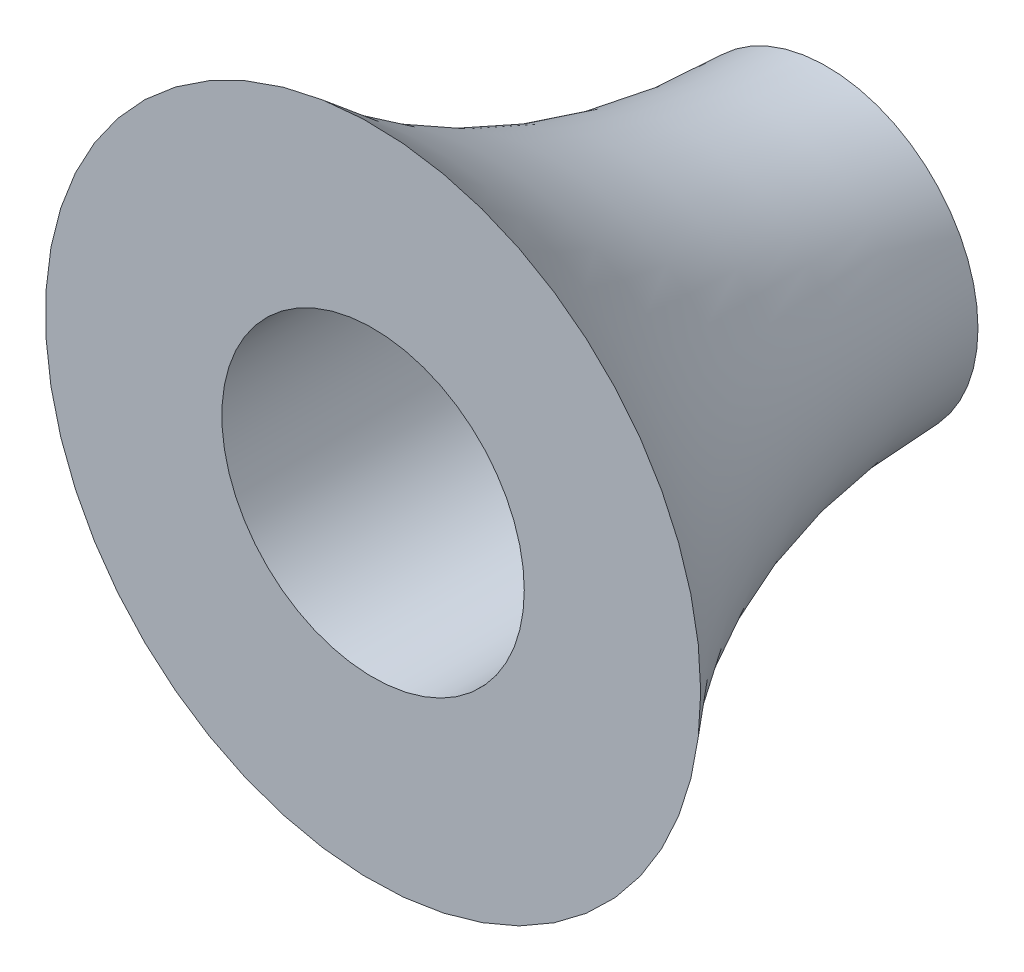
ISO-10303-21;
HEADER;
FILE_DESCRIPTION(('STEP AP214'),'2;1');
FILE_NAME('part.step','',(''),(''),'','','');
FILE_SCHEMA(('AUTOMOTIVE_DESIGN { 1 0 10303 214 1 1 1 1 }'));
ENDSEC;
DATA;
#1=APPLICATION_CONTEXT('core data for automotive mechanical design processes');
#2=APPLICATION_PROTOCOL_DEFINITION('international standard','automotive_design',2000,#1);
#3=PRODUCT_CONTEXT('',#1,'mechanical');
#4=PRODUCT('Part','Part','',(#3));
#5=PRODUCT_RELATED_PRODUCT_CATEGORY('part','',(#4));
#6=PRODUCT_DEFINITION_FORMATION('','',#4);
#7=PRODUCT_DEFINITION_CONTEXT('part definition',#1,'design');
#8=PRODUCT_DEFINITION('design','',#6,#7);
#9=PRODUCT_DEFINITION_SHAPE('','',#8);
#10=(LENGTH_UNIT() NAMED_UNIT(*) SI_UNIT(.MILLI.,.METRE.));
#11=(NAMED_UNIT(*) PLANE_ANGLE_UNIT() SI_UNIT($,.RADIAN.));
#12=(NAMED_UNIT(*) SI_UNIT($,.STERADIAN.) SOLID_ANGLE_UNIT());
#13=UNCERTAINTY_MEASURE_WITH_UNIT(LENGTH_MEASURE(1.E-05),#10,'distance_accuracy_value','');
#14=(GEOMETRIC_REPRESENTATION_CONTEXT(3) GLOBAL_UNCERTAINTY_ASSIGNED_CONTEXT((#13)) GLOBAL_UNIT_ASSIGNED_CONTEXT((#10,
#11,#12)) REPRESENTATION_CONTEXT('',''));
#15=CARTESIAN_POINT('',(0.,0.,0.));
#16=DIRECTION('',(0.,0.,1.));
#17=DIRECTION('',(1.,0.,0.));
#18=AXIS2_PLACEMENT_3D('',#15,#16,#17);
#19=CARTESIAN_POINT('',(0.341944734678672,-5.08305526532133,-7.02));
#20=DIRECTION('',(0.,0.,1.));
#21=DIRECTION('',(1.,0.,0.));
#22=AXIS2_PLACEMENT_3D('',#19,#20,#21);
#23=PLANE('',#22);
#24=CARTESIAN_POINT('',(1.225,-4.2,-7.02));
#25=DIRECTION('',(0.,0.,1.));
#26=DIRECTION('',(1.,0.,0.));
#27=AXIS2_PLACEMENT_3D('',#24,#25,#26);
#28=CIRCLE('',#27,0.299999999999998);
#29=CARTESIAN_POINT('',(1.525,-4.2,-7.02));
#30=VERTEX_POINT('',#29);
#31=EDGE_CURVE('E19',#30,#30,#28,.T.);
#32=ORIENTED_EDGE('',*,*,#31,.F.);
#33=EDGE_LOOP('',(#32));
#34=FACE_BOUND('',#33,.T.);
#35=CARTESIAN_POINT('',(1.225,-4.2,-7.02000000000018));
#36=DIRECTION('',(0.,0.,1.));
#37=DIRECTION('',(1.,0.,0.));
#38=AXIS2_PLACEMENT_3D('',#35,#36,#37);
#39=CIRCLE('',#38,0.650000000000852);
#40=CARTESIAN_POINT('',(1.87500000000085,-4.2,-7.02000000000018));
#41=VERTEX_POINT('',#40);
#42=EDGE_CURVE('E23',#41,#41,#39,.F.);
#43=ORIENTED_EDGE('',*,*,#42,.F.);
#44=EDGE_LOOP('',(#43));
#45=FACE_BOUND('',#44,.T.);
#46=ADVANCED_FACE('F15',(#34,#45),#23,.T.);
#47=CARTESIAN_POINT('',(1.225,-4.2,-7.92));
#48=DIRECTION('',(0.,0.,1.));
#49=DIRECTION('',(1.,0.,0.));
#50=AXIS2_PLACEMENT_3D('',#47,#48,#49);
#51=CYLINDRICAL_SURFACE('',#50,0.299999999999998);
#52=ORIENTED_EDGE('',*,*,#31,.T.);
#53=EDGE_LOOP('',(#52));
#54=FACE_BOUND('',#53,.T.);
#55=CARTESIAN_POINT('',(1.225,-4.2,-7.92));
#56=DIRECTION('',(0.,0.,1.));
#57=DIRECTION('',(1.,0.,0.));
#58=AXIS2_PLACEMENT_3D('',#55,#56,#57);
#59=CIRCLE('',#58,0.299999999999998);
#60=CARTESIAN_POINT('',(1.525,-4.2,-7.92));
#61=VERTEX_POINT('',#60);
#62=EDGE_CURVE('E10',#61,#61,#59,.T.);
#63=ORIENTED_EDGE('',*,*,#62,.F.);
#64=EDGE_LOOP('',(#63));
#65=FACE_BOUND('',#64,.T.);
#66=ADVANCED_FACE('F33',(#54,#65),#51,.F.);
#67=CARTESIAN_POINT('',(1.225,-4.2,-7.92));
#68=DIRECTION('',(0.,0.,1.));
#69=DIRECTION('',(1.,0.,0.));
#70=AXIS2_PLACEMENT_3D('',#67,#68,#69);
#71=TOROIDAL_SURFACE('',#70,1.63214285714002,1.33214285714002);
#72=ORIENTED_EDGE('',*,*,#62,.T.);
#73=EDGE_LOOP('',(#72));
#74=FACE_BOUND('',#73,.T.);
#75=ORIENTED_EDGE('',*,*,#42,.T.);
#76=EDGE_LOOP('',(#75));
#77=FACE_BOUND('',#76,.T.);
#78=ADVANCED_FACE('F17',(#74,#77),#71,.F.);
#79=CLOSED_SHELL('',(#46,#66,#78));
#80=MANIFOLD_SOLID_BREP('B1',#79);
#81=ADVANCED_BREP_SHAPE_REPRESENTATION('',(#18,#80),#14);
#82=SHAPE_DEFINITION_REPRESENTATION(#9,#81);
ENDSEC;
END-ISO-10303-21;
